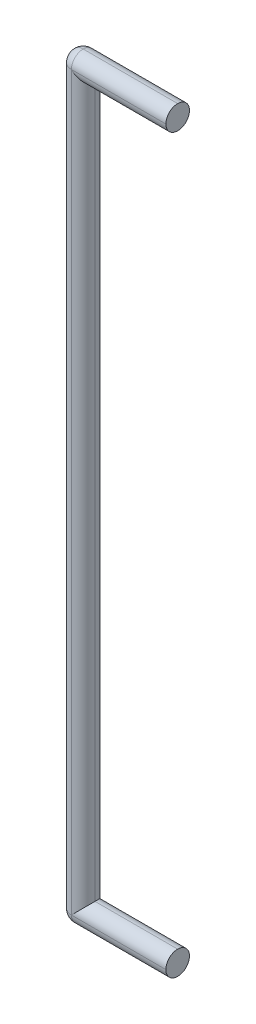
ISO-10303-21;
HEADER;
FILE_DESCRIPTION(('STEP AP214'),'2;1');
FILE_NAME('part.step','',(''),(''),'','','');
FILE_SCHEMA(('AUTOMOTIVE_DESIGN { 1 0 10303 214 1 1 1 1 }'));
ENDSEC;
DATA;
#1=APPLICATION_CONTEXT('core data for automotive mechanical design processes');
#2=APPLICATION_PROTOCOL_DEFINITION('international standard','automotive_design',2000,#1);
#3=PRODUCT_CONTEXT('',#1,'mechanical');
#4=PRODUCT('Part','Part','',(#3));
#5=PRODUCT_RELATED_PRODUCT_CATEGORY('part','',(#4));
#6=PRODUCT_DEFINITION_FORMATION('','',#4);
#7=PRODUCT_DEFINITION_CONTEXT('part definition',#1,'design');
#8=PRODUCT_DEFINITION('design','',#6,#7);
#9=PRODUCT_DEFINITION_SHAPE('','',#8);
#10=(LENGTH_UNIT() NAMED_UNIT(*) SI_UNIT(.MILLI.,.METRE.));
#11=(NAMED_UNIT(*) PLANE_ANGLE_UNIT() SI_UNIT($,.RADIAN.));
#12=(NAMED_UNIT(*) SI_UNIT($,.STERADIAN.) SOLID_ANGLE_UNIT());
#13=UNCERTAINTY_MEASURE_WITH_UNIT(LENGTH_MEASURE(1.E-05),#10,'distance_accuracy_value','');
#14=(GEOMETRIC_REPRESENTATION_CONTEXT(3) GLOBAL_UNCERTAINTY_ASSIGNED_CONTEXT((#13)) GLOBAL_UNIT_ASSIGNED_CONTEXT((#10,
#11,#12)) REPRESENTATION_CONTEXT('',''));
#15=CARTESIAN_POINT('',(0.,0.,0.));
#16=DIRECTION('',(0.,0.,1.));
#17=DIRECTION('',(1.,0.,0.));
#18=AXIS2_PLACEMENT_3D('',#15,#16,#17);
#19=CARTESIAN_POINT('',(4.,0.,0.));
#20=DIRECTION('',(-1.,0.,0.));
#21=DIRECTION('',(0.,0.,1.));
#22=AXIS2_PLACEMENT_3D('',#19,#20,#21);
#23=PLANE('',#22);
#24=CARTESIAN_POINT('',(4.,-0.5,0.));
#25=DIRECTION('',(-1.,0.,0.));
#26=DIRECTION('',(0.,0.,1.));
#27=AXIS2_PLACEMENT_3D('',#24,#25,#26);
#28=CIRCLE('',#27,0.5);
#29=CARTESIAN_POINT('',(4.,0.,0.));
#30=VERTEX_POINT('',#29);
#31=CARTESIAN_POINT('',(4.,-0.5,0.5));
#32=VERTEX_POINT('',#31);
#33=EDGE_CURVE('E105',#30,#32,#28,.F.);
#34=ORIENTED_EDGE('',*,*,#33,.T.);
#35=CARTESIAN_POINT('',(4.,-0.5,0.));
#36=DIRECTION('',(-1.,0.,0.));
#37=DIRECTION('',(0.,0.,1.));
#38=AXIS2_PLACEMENT_3D('',#35,#36,#37);
#39=CIRCLE('',#38,0.5);
#40=CARTESIAN_POINT('',(4.,-1.,0.));
#41=VERTEX_POINT('',#40);
#42=EDGE_CURVE('E109',#32,#41,#39,.F.);
#43=ORIENTED_EDGE('',*,*,#42,.T.);
#44=CARTESIAN_POINT('',(4.,-0.5,0.));
#45=DIRECTION('',(-1.,0.,0.));
#46=DIRECTION('',(0.,0.,1.));
#47=AXIS2_PLACEMENT_3D('',#44,#45,#46);
#48=CIRCLE('',#47,0.5);
#49=CARTESIAN_POINT('',(4.,-0.5,-0.5));
#50=VERTEX_POINT('',#49);
#51=EDGE_CURVE('E139',#41,#50,#48,.F.);
#52=ORIENTED_EDGE('',*,*,#51,.T.);
#53=CARTESIAN_POINT('',(4.,-0.5,0.));
#54=DIRECTION('',(-1.,0.,0.));
#55=DIRECTION('',(0.,0.,1.));
#56=AXIS2_PLACEMENT_3D('',#53,#54,#55);
#57=CIRCLE('',#56,0.5);
#58=EDGE_CURVE('E111',#50,#30,#57,.F.);
#59=ORIENTED_EDGE('',*,*,#58,.T.);
#60=EDGE_LOOP('',(#34,#43,#52,#59));
#61=FACE_BOUND('',#60,.T.);
#62=ADVANCED_FACE('F38',(#61),#23,.F.);
#63=CARTESIAN_POINT('',(4.,0.,0.));
#64=DIRECTION('',(1.,0.,0.));
#65=DIRECTION('',(0.,0.,-1.));
#66=AXIS2_PLACEMENT_3D('',#63,#64,#65);
#67=PLANE('',#66);
#68=CARTESIAN_POINT('',(4.,30.5,0.));
#69=DIRECTION('',(1.,0.,0.));
#70=DIRECTION('',(0.,0.,-1.));
#71=AXIS2_PLACEMENT_3D('',#68,#69,#70);
#72=CIRCLE('',#71,0.5);
#73=CARTESIAN_POINT('',(4.,30.5,-0.499999999999996));
#74=VERTEX_POINT('',#73);
#75=CARTESIAN_POINT('',(4.,31.,0.));
#76=VERTEX_POINT('',#75);
#77=EDGE_CURVE('E148',#74,#76,#72,.T.);
#78=ORIENTED_EDGE('',*,*,#77,.T.);
#79=CARTESIAN_POINT('',(4.,30.5,0.));
#80=DIRECTION('',(1.,0.,0.));
#81=DIRECTION('',(0.,0.,-1.));
#82=AXIS2_PLACEMENT_3D('',#79,#80,#81);
#83=CIRCLE('',#82,0.5);
#84=CARTESIAN_POINT('',(4.,30.5,0.500000000000004));
#85=VERTEX_POINT('',#84);
#86=EDGE_CURVE('E170',#76,#85,#83,.T.);
#87=ORIENTED_EDGE('',*,*,#86,.T.);
#88=CARTESIAN_POINT('',(4.,30.5,0.));
#89=DIRECTION('',(1.,0.,0.));
#90=DIRECTION('',(0.,0.,-1.));
#91=AXIS2_PLACEMENT_3D('',#88,#89,#90);
#92=CIRCLE('',#91,0.5);
#93=CARTESIAN_POINT('',(4.,30.,0.));
#94=VERTEX_POINT('',#93);
#95=EDGE_CURVE('E168',#85,#94,#92,.T.);
#96=ORIENTED_EDGE('',*,*,#95,.T.);
#97=CARTESIAN_POINT('',(4.,30.5,0.));
#98=DIRECTION('',(1.,0.,0.));
#99=DIRECTION('',(0.,0.,-1.));
#100=AXIS2_PLACEMENT_3D('',#97,#98,#99);
#101=CIRCLE('',#100,0.5);
#102=EDGE_CURVE('E166',#94,#74,#101,.T.);
#103=ORIENTED_EDGE('',*,*,#102,.T.);
#104=EDGE_LOOP('',(#78,#87,#96,#103));
#105=FACE_BOUND('',#104,.T.);
#106=ADVANCED_FACE('F214',(#105),#67,.T.);
#107=CARTESIAN_POINT('',(0.5,-0.5,0.));
#108=DIRECTION('',(-1.,0.,0.));
#109=DIRECTION('',(0.,0.,1.));
#110=AXIS2_PLACEMENT_3D('',#107,#108,#109);
#111=CYLINDRICAL_SURFACE('',#110,0.5);
#112=DIRECTION('',(1.,0.,0.));
#113=VECTOR('',#112,1.);
#114=CARTESIAN_POINT('',(0.5,0.,0.));
#115=LINE('',#114,#113);
#116=CARTESIAN_POINT('',(0.5,0.,0.));
#117=VERTEX_POINT('',#116);
#118=EDGE_CURVE('E137',#30,#117,#115,.F.);
#119=ORIENTED_EDGE('',*,*,#118,.F.);
#120=ORIENTED_EDGE('',*,*,#58,.F.);
#121=DIRECTION('',(1.,0.,0.));
#122=VECTOR('',#121,1.);
#123=CARTESIAN_POINT('',(-0.5,-0.5,-0.5));
#124=LINE('',#123,#122);
#125=CARTESIAN_POINT('',(0.,-0.5,-0.5));
#126=VERTEX_POINT('',#125);
#127=EDGE_CURVE('E129',#50,#126,#124,.F.);
#128=ORIENTED_EDGE('',*,*,#127,.T.);
#129=CARTESIAN_POINT('',(0.,-0.5,0.));
#130=DIRECTION('',(0.707106781186547,-0.707106781186547,0.));
#131=DIRECTION('',(-0.707106781186547,-0.707106781186547,0.));
#132=AXIS2_PLACEMENT_3D('',#129,#130,#131);
#133=ELLIPSE('',#132,0.707106781186547,0.5);
#134=EDGE_CURVE('E145',#126,#117,#133,.T.);
#135=ORIENTED_EDGE('',*,*,#134,.T.);
#136=EDGE_LOOP('',(#119,#120,#128,#135));
#137=FACE_BOUND('',#136,.T.);
#138=ADVANCED_FACE('F236',(#137),#111,.T.);
#139=CARTESIAN_POINT('',(-0.5,-0.5,0.));
#140=DIRECTION('',(-1.,0.,0.));
#141=DIRECTION('',(0.,0.,1.));
#142=AXIS2_PLACEMENT_3D('',#139,#140,#141);
#143=CYLINDRICAL_SURFACE('',#142,0.5);
#144=DIRECTION('',(1.,0.,0.));
#145=VECTOR('',#144,1.);
#146=CARTESIAN_POINT('',(4.,-1.,0.));
#147=LINE('',#146,#145);
#148=CARTESIAN_POINT('',(0.,-1.,0.));
#149=VERTEX_POINT('',#148);
#150=EDGE_CURVE('E123',#149,#41,#147,.T.);
#151=ORIENTED_EDGE('',*,*,#150,.F.);
#152=CARTESIAN_POINT('',(0.,-0.5,0.));
#153=DIRECTION('',(-1.,0.,0.));
#154=DIRECTION('',(0.,0.,1.));
#155=AXIS2_PLACEMENT_3D('',#152,#153,#154);
#156=CIRCLE('',#155,0.5);
#157=EDGE_CURVE('E132',#149,#126,#156,.F.);
#158=ORIENTED_EDGE('',*,*,#157,.T.);
#159=ORIENTED_EDGE('',*,*,#127,.F.);
#160=ORIENTED_EDGE('',*,*,#51,.F.);
#161=EDGE_LOOP('',(#151,#158,#159,#160));
#162=FACE_BOUND('',#161,.T.);
#163=ADVANCED_FACE('F244',(#162),#143,.T.);
#164=CARTESIAN_POINT('',(-0.5,-0.5,0.));
#165=DIRECTION('',(-1.,0.,0.));
#166=DIRECTION('',(0.,0.,1.));
#167=AXIS2_PLACEMENT_3D('',#164,#165,#166);
#168=CYLINDRICAL_SURFACE('',#167,0.5);
#169=ORIENTED_EDGE('',*,*,#118,.T.);
#170=CARTESIAN_POINT('',(0.,-0.5,0.));
#171=DIRECTION('',(0.707106781186547,-0.707106781186547,0.));
#172=DIRECTION('',(-0.707106781186547,-0.707106781186547,0.));
#173=AXIS2_PLACEMENT_3D('',#170,#171,#172);
#174=ELLIPSE('',#173,0.707106781186547,0.5);
#175=CARTESIAN_POINT('',(0.,-0.5,0.5));
#176=VERTEX_POINT('',#175);
#177=EDGE_CURVE('E120',#117,#176,#174,.T.);
#178=ORIENTED_EDGE('',*,*,#177,.T.);
#179=DIRECTION('',(1.,0.,0.));
#180=VECTOR('',#179,1.);
#181=CARTESIAN_POINT('',(0.5,-0.5,0.5));
#182=LINE('',#181,#180);
#183=EDGE_CURVE('E117',#32,#176,#182,.F.);
#184=ORIENTED_EDGE('',*,*,#183,.F.);
#185=ORIENTED_EDGE('',*,*,#33,.F.);
#186=EDGE_LOOP('',(#169,#178,#184,#185));
#187=FACE_BOUND('',#186,.T.);
#188=ADVANCED_FACE('F118',(#187),#168,.T.);
#189=CARTESIAN_POINT('',(0.5,-0.5,0.));
#190=DIRECTION('',(-1.,0.,0.));
#191=DIRECTION('',(0.,0.,1.));
#192=AXIS2_PLACEMENT_3D('',#189,#190,#191);
#193=CYLINDRICAL_SURFACE('',#192,0.5);
#194=ORIENTED_EDGE('',*,*,#183,.T.);
#195=CARTESIAN_POINT('',(0.,-0.5,0.));
#196=DIRECTION('',(-1.,0.,0.));
#197=DIRECTION('',(0.,0.,1.));
#198=AXIS2_PLACEMENT_3D('',#195,#196,#197);
#199=CIRCLE('',#198,0.5);
#200=EDGE_CURVE('E142',#176,#149,#199,.F.);
#201=ORIENTED_EDGE('',*,*,#200,.T.);
#202=ORIENTED_EDGE('',*,*,#150,.T.);
#203=ORIENTED_EDGE('',*,*,#42,.F.);
#204=EDGE_LOOP('',(#194,#201,#202,#203));
#205=FACE_BOUND('',#204,.T.);
#206=ADVANCED_FACE('F126',(#205),#193,.T.);
#207=CARTESIAN_POINT('',(0.,30.,0.));
#208=DIRECTION('',(0.,-1.,0.));
#209=DIRECTION('',(0.,0.,-1.));
#210=AXIS2_PLACEMENT_3D('',#207,#208,#209);
#211=CYLINDRICAL_SURFACE('',#210,0.5);
#212=DIRECTION('',(0.,-1.,0.));
#213=VECTOR('',#212,1.);
#214=CARTESIAN_POINT('',(0.,30.,0.5));
#215=LINE('',#214,#213);
#216=CARTESIAN_POINT('',(0.,30.5,0.5));
#217=VERTEX_POINT('',#216);
#218=EDGE_CURVE('E161',#176,#217,#215,.F.);
#219=ORIENTED_EDGE('',*,*,#218,.F.);
#220=ORIENTED_EDGE('',*,*,#177,.F.);
#221=DIRECTION('',(0.,-1.,0.));
#222=VECTOR('',#221,1.);
#223=CARTESIAN_POINT('',(0.5,30.,0.));
#224=LINE('',#223,#222);
#225=CARTESIAN_POINT('',(0.5,30.,0.));
#226=VERTEX_POINT('',#225);
#227=EDGE_CURVE('E124',#226,#117,#224,.T.);
#228=ORIENTED_EDGE('',*,*,#227,.F.);
#229=CARTESIAN_POINT('',(0.,30.5,0.));
#230=DIRECTION('',(-0.707106781186547,-0.707106781186547,0.));
#231=DIRECTION('',(-0.707106781186547,0.707106781186547,0.));
#232=AXIS2_PLACEMENT_3D('',#229,#230,#231);
#233=ELLIPSE('',#232,0.707106781186547,0.5);
#234=EDGE_CURVE('E48',#226,#217,#233,.T.);
#235=ORIENTED_EDGE('',*,*,#234,.T.);
#236=EDGE_LOOP('',(#219,#220,#228,#235));
#237=FACE_BOUND('',#236,.T.);
#238=ADVANCED_FACE('F241',(#237),#211,.T.);
#239=CARTESIAN_POINT('',(0.,30.,0.));
#240=DIRECTION('',(0.,-1.,0.));
#241=DIRECTION('',(0.,0.,-1.));
#242=AXIS2_PLACEMENT_3D('',#239,#240,#241);
#243=CYLINDRICAL_SURFACE('',#242,0.5);
#244=ORIENTED_EDGE('',*,*,#227,.T.);
#245=ORIENTED_EDGE('',*,*,#134,.F.);
#246=DIRECTION('',(0.,-1.,0.));
#247=VECTOR('',#246,1.);
#248=CARTESIAN_POINT('',(0.,30.,-0.5));
#249=LINE('',#248,#247);
#250=CARTESIAN_POINT('',(0.,30.5,-0.5));
#251=VERTEX_POINT('',#250);
#252=EDGE_CURVE('E55',#126,#251,#249,.F.);
#253=ORIENTED_EDGE('',*,*,#252,.T.);
#254=CARTESIAN_POINT('',(0.,30.5,0.));
#255=DIRECTION('',(-0.707106781186547,-0.707106781186547,0.));
#256=DIRECTION('',(-0.707106781186547,0.707106781186547,0.));
#257=AXIS2_PLACEMENT_3D('',#254,#255,#256);
#258=ELLIPSE('',#257,0.707106781186547,0.5);
#259=EDGE_CURVE('E11',#251,#226,#258,.T.);
#260=ORIENTED_EDGE('',*,*,#259,.T.);
#261=EDGE_LOOP('',(#244,#245,#253,#260));
#262=FACE_BOUND('',#261,.T.);
#263=ADVANCED_FACE('F266',(#262),#243,.T.);
#264=CARTESIAN_POINT('',(0.,30.,0.));
#265=DIRECTION('',(0.,-1.,0.));
#266=DIRECTION('',(0.,0.,-1.));
#267=AXIS2_PLACEMENT_3D('',#264,#265,#266);
#268=CYLINDRICAL_SURFACE('',#267,0.5);
#269=ORIENTED_EDGE('',*,*,#218,.T.);
#270=CARTESIAN_POINT('',(0.,30.5,0.));
#271=DIRECTION('',(0.,-1.,0.));
#272=DIRECTION('',(0.,0.,-1.));
#273=AXIS2_PLACEMENT_3D('',#270,#271,#272);
#274=CIRCLE('',#273,0.5);
#275=CARTESIAN_POINT('',(-0.5,30.5,0.));
#276=VERTEX_POINT('',#275);
#277=EDGE_CURVE('E173',#217,#276,#274,.T.);
#278=ORIENTED_EDGE('',*,*,#277,.T.);
#279=DIRECTION('',(0.,-1.,0.));
#280=VECTOR('',#279,1.);
#281=CARTESIAN_POINT('',(-0.5,30.,0.));
#282=LINE('',#281,#280);
#283=CARTESIAN_POINT('',(-0.5,-0.5,0.));
#284=VERTEX_POINT('',#283);
#285=EDGE_CURVE('E158',#284,#276,#282,.F.);
#286=ORIENTED_EDGE('',*,*,#285,.F.);
#287=CARTESIAN_POINT('',(0.,-0.5,0.));
#288=DIRECTION('',(0.,-1.,0.));
#289=DIRECTION('',(0.,0.,-1.));
#290=AXIS2_PLACEMENT_3D('',#287,#288,#289);
#291=CIRCLE('',#290,0.5);
#292=EDGE_CURVE('E155',#176,#284,#291,.T.);
#293=ORIENTED_EDGE('',*,*,#292,.F.);
#294=EDGE_LOOP('',(#269,#278,#286,#293));
#295=FACE_BOUND('',#294,.T.);
#296=ADVANCED_FACE('F262',(#295),#268,.T.);
#297=CARTESIAN_POINT('',(0.,30.,0.));
#298=DIRECTION('',(0.,-1.,0.));
#299=DIRECTION('',(0.,0.,-1.));
#300=AXIS2_PLACEMENT_3D('',#297,#298,#299);
#301=CYLINDRICAL_SURFACE('',#300,0.5);
#302=ORIENTED_EDGE('',*,*,#285,.T.);
#303=CARTESIAN_POINT('',(0.,30.5,0.));
#304=DIRECTION('',(0.,-1.,0.));
#305=DIRECTION('',(0.,0.,-1.));
#306=AXIS2_PLACEMENT_3D('',#303,#304,#305);
#307=CIRCLE('',#306,0.5);
#308=EDGE_CURVE('E176',#276,#251,#307,.T.);
#309=ORIENTED_EDGE('',*,*,#308,.T.);
#310=ORIENTED_EDGE('',*,*,#252,.F.);
#311=CARTESIAN_POINT('',(0.,-0.5,0.));
#312=DIRECTION('',(0.,-1.,0.));
#313=DIRECTION('',(0.,0.,-1.));
#314=AXIS2_PLACEMENT_3D('',#311,#312,#313);
#315=CIRCLE('',#314,0.5);
#316=EDGE_CURVE('E152',#284,#126,#315,.T.);
#317=ORIENTED_EDGE('',*,*,#316,.F.);
#318=EDGE_LOOP('',(#302,#309,#310,#317));
#319=FACE_BOUND('',#318,.T.);
#320=ADVANCED_FACE('F258',(#319),#301,.T.);
#321=CARTESIAN_POINT('',(0.,-0.5,0.));
#322=DIRECTION('',(1.,0.,0.));
#323=DIRECTION('',(0.,0.,-1.));
#324=AXIS2_PLACEMENT_3D('',#321,#322,#323);
#325=SPHERICAL_SURFACE('',#324,0.5);
#326=ORIENTED_EDGE('',*,*,#200,.F.);
#327=ORIENTED_EDGE('',*,*,#292,.T.);
#328=CARTESIAN_POINT('',(0.,-0.5,0.));
#329=DIRECTION('',(0.,0.,-1.));
#330=DIRECTION('',(0.,1.,0.));
#331=AXIS2_PLACEMENT_3D('',#328,#329,#330);
#332=CIRCLE('',#331,0.5);
#333=EDGE_CURVE('E149',#149,#284,#332,.T.);
#334=ORIENTED_EDGE('',*,*,#333,.F.);
#335=EDGE_LOOP('',(#326,#327,#334));
#336=FACE_BOUND('',#335,.T.);
#337=ADVANCED_FACE('F254',(#336),#325,.T.);
#338=CARTESIAN_POINT('',(0.,-0.5,0.));
#339=DIRECTION('',(1.,0.,0.));
#340=DIRECTION('',(0.,0.,-1.));
#341=AXIS2_PLACEMENT_3D('',#338,#339,#340);
#342=SPHERICAL_SURFACE('',#341,0.5);
#343=ORIENTED_EDGE('',*,*,#316,.T.);
#344=ORIENTED_EDGE('',*,*,#157,.F.);
#345=ORIENTED_EDGE('',*,*,#333,.T.);
#346=EDGE_LOOP('',(#343,#344,#345));
#347=FACE_BOUND('',#346,.T.);
#348=ADVANCED_FACE('F251',(#347),#342,.T.);
#349=CARTESIAN_POINT('',(0.,30.5,0.));
#350=DIRECTION('',(0.,1.,0.));
#351=DIRECTION('',(0.,0.,1.));
#352=AXIS2_PLACEMENT_3D('',#349,#350,#351);
#353=SPHERICAL_SURFACE('',#352,0.5);
#354=CARTESIAN_POINT('',(0.,30.5,0.));
#355=DIRECTION('',(1.,0.,0.));
#356=DIRECTION('',(0.,0.,-1.));
#357=AXIS2_PLACEMENT_3D('',#354,#355,#356);
#358=CIRCLE('',#357,0.5);
#359=CARTESIAN_POINT('',(0.,31.,0.));
#360=VERTEX_POINT('',#359);
#361=EDGE_CURVE('E191',#251,#360,#358,.T.);
#362=ORIENTED_EDGE('',*,*,#361,.F.);
#363=ORIENTED_EDGE('',*,*,#308,.F.);
#364=CARTESIAN_POINT('',(0.,30.5,0.));
#365=DIRECTION('',(0.,0.,1.));
#366=DIRECTION('',(1.,0.,0.));
#367=AXIS2_PLACEMENT_3D('',#364,#365,#366);
#368=CIRCLE('',#367,0.5);
#369=EDGE_CURVE('E193',#360,#276,#368,.T.);
#370=ORIENTED_EDGE('',*,*,#369,.F.);
#371=EDGE_LOOP('',(#362,#363,#370));
#372=FACE_BOUND('',#371,.T.);
#373=ADVANCED_FACE('F40',(#372),#353,.T.);
#374=CARTESIAN_POINT('',(-0.5,30.5,0.));
#375=DIRECTION('',(-1.,0.,0.));
#376=DIRECTION('',(0.,0.,1.));
#377=AXIS2_PLACEMENT_3D('',#374,#375,#376);
#378=CYLINDRICAL_SURFACE('',#377,0.5);
#379=DIRECTION('',(1.,0.,0.));
#380=VECTOR('',#379,1.);
#381=CARTESIAN_POINT('',(0.,30.5,-0.5));
#382=LINE('',#381,#380);
#383=EDGE_CURVE('E188',#74,#251,#382,.F.);
#384=ORIENTED_EDGE('',*,*,#383,.F.);
#385=ORIENTED_EDGE('',*,*,#102,.F.);
#386=DIRECTION('',(1.,0.,0.));
#387=VECTOR('',#386,1.);
#388=CARTESIAN_POINT('',(4.,30.,0.));
#389=LINE('',#388,#387);
#390=EDGE_CURVE('E42',#226,#94,#389,.T.);
#391=ORIENTED_EDGE('',*,*,#390,.F.);
#392=ORIENTED_EDGE('',*,*,#259,.F.);
#393=EDGE_LOOP('',(#384,#385,#391,#392));
#394=FACE_BOUND('',#393,.T.);
#395=ADVANCED_FACE('F210',(#394),#378,.T.);
#396=CARTESIAN_POINT('',(0.5,30.5,0.));
#397=DIRECTION('',(-1.,0.,0.));
#398=DIRECTION('',(0.,0.,1.));
#399=AXIS2_PLACEMENT_3D('',#396,#397,#398);
#400=CYLINDRICAL_SURFACE('',#399,0.5);
#401=ORIENTED_EDGE('',*,*,#390,.T.);
#402=ORIENTED_EDGE('',*,*,#95,.F.);
#403=DIRECTION('',(1.,0.,0.));
#404=VECTOR('',#403,1.);
#405=CARTESIAN_POINT('',(4.,30.5,0.5));
#406=LINE('',#405,#404);
#407=EDGE_CURVE('E186',#217,#85,#406,.T.);
#408=ORIENTED_EDGE('',*,*,#407,.F.);
#409=ORIENTED_EDGE('',*,*,#234,.F.);
#410=EDGE_LOOP('',(#401,#402,#408,#409));
#411=FACE_BOUND('',#410,.T.);
#412=ADVANCED_FACE('F204',(#411),#400,.T.);
#413=CARTESIAN_POINT('',(0.,30.5,0.));
#414=DIRECTION('',(0.,1.,0.));
#415=DIRECTION('',(0.,0.,1.));
#416=AXIS2_PLACEMENT_3D('',#413,#414,#415);
#417=SPHERICAL_SURFACE('',#416,0.5);
#418=ORIENTED_EDGE('',*,*,#369,.T.);
#419=ORIENTED_EDGE('',*,*,#277,.F.);
#420=CARTESIAN_POINT('',(0.,30.5,0.));
#421=DIRECTION('',(1.,0.,0.));
#422=DIRECTION('',(0.,0.,-1.));
#423=AXIS2_PLACEMENT_3D('',#420,#421,#422);
#424=CIRCLE('',#423,0.5);
#425=EDGE_CURVE('E183',#360,#217,#424,.T.);
#426=ORIENTED_EDGE('',*,*,#425,.F.);
#427=EDGE_LOOP('',(#418,#419,#426));
#428=FACE_BOUND('',#427,.T.);
#429=ADVANCED_FACE('F219',(#428),#417,.T.);
#430=CARTESIAN_POINT('',(0.5,30.5,0.));
#431=DIRECTION('',(-1.,0.,0.));
#432=DIRECTION('',(0.,0.,1.));
#433=AXIS2_PLACEMENT_3D('',#430,#431,#432);
#434=CYLINDRICAL_SURFACE('',#433,0.5);
#435=ORIENTED_EDGE('',*,*,#383,.T.);
#436=ORIENTED_EDGE('',*,*,#361,.T.);
#437=DIRECTION('',(1.,0.,0.));
#438=VECTOR('',#437,1.);
#439=CARTESIAN_POINT('',(0.,31.,0.));
#440=LINE('',#439,#438);
#441=EDGE_CURVE('E180',#76,#360,#440,.F.);
#442=ORIENTED_EDGE('',*,*,#441,.F.);
#443=ORIENTED_EDGE('',*,*,#77,.F.);
#444=EDGE_LOOP('',(#435,#436,#442,#443));
#445=FACE_BOUND('',#444,.T.);
#446=ADVANCED_FACE('F222',(#445),#434,.T.);
#447=CARTESIAN_POINT('',(-0.5,30.5,0.));
#448=DIRECTION('',(-1.,0.,0.));
#449=DIRECTION('',(0.,0.,1.));
#450=AXIS2_PLACEMENT_3D('',#447,#448,#449);
#451=CYLINDRICAL_SURFACE('',#450,0.5);
#452=ORIENTED_EDGE('',*,*,#425,.T.);
#453=ORIENTED_EDGE('',*,*,#407,.T.);
#454=ORIENTED_EDGE('',*,*,#86,.F.);
#455=ORIENTED_EDGE('',*,*,#441,.T.);
#456=EDGE_LOOP('',(#452,#453,#454,#455));
#457=FACE_BOUND('',#456,.T.);
#458=ADVANCED_FACE('F218',(#457),#451,.T.);
#459=CLOSED_SHELL('',(#62,#106,#138,#163,#188,#206,#238,#263,#296,#320,#337,#348,#373,#395,#412,
#429,#446,#458));
#460=MANIFOLD_SOLID_BREP('B2',#459);
#461=ADVANCED_BREP_SHAPE_REPRESENTATION('',(#18,#460),#14);
#462=SHAPE_DEFINITION_REPRESENTATION(#9,#461);
ENDSEC;
END-ISO-10303-21;
